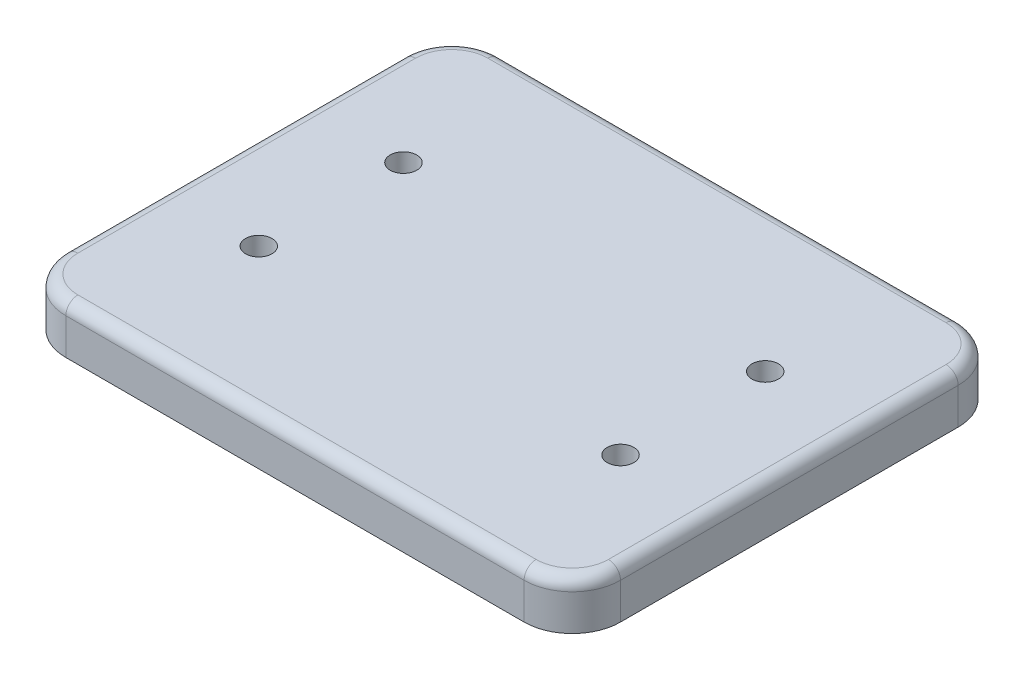
ISO-10303-21;
HEADER;
FILE_DESCRIPTION(('STEP AP214'),'2;1');
FILE_NAME('part.step','',(''),(''),'','','');
FILE_SCHEMA(('AUTOMOTIVE_DESIGN { 1 0 10303 214 1 1 1 1 }'));
ENDSEC;
DATA;
#1=APPLICATION_CONTEXT('core data for automotive mechanical design processes');
#2=APPLICATION_PROTOCOL_DEFINITION('international standard','automotive_design',2000,#1);
#3=PRODUCT_CONTEXT('',#1,'mechanical');
#4=PRODUCT('Part','Part','',(#3));
#5=PRODUCT_RELATED_PRODUCT_CATEGORY('part','',(#4));
#6=PRODUCT_DEFINITION_FORMATION('','',#4);
#7=PRODUCT_DEFINITION_CONTEXT('part definition',#1,'design');
#8=PRODUCT_DEFINITION('design','',#6,#7);
#9=PRODUCT_DEFINITION_SHAPE('','',#8);
#10=(LENGTH_UNIT() NAMED_UNIT(*) SI_UNIT(.MILLI.,.METRE.));
#11=(NAMED_UNIT(*) PLANE_ANGLE_UNIT() SI_UNIT($,.RADIAN.));
#12=(NAMED_UNIT(*) SI_UNIT($,.STERADIAN.) SOLID_ANGLE_UNIT());
#13=UNCERTAINTY_MEASURE_WITH_UNIT(LENGTH_MEASURE(1.E-05),#10,'distance_accuracy_value','');
#14=(GEOMETRIC_REPRESENTATION_CONTEXT(3) GLOBAL_UNCERTAINTY_ASSIGNED_CONTEXT((#13)) GLOBAL_UNIT_ASSIGNED_CONTEXT((#10,
#11,#12)) REPRESENTATION_CONTEXT('',''));
#15=CARTESIAN_POINT('',(0.,0.,0.));
#16=DIRECTION('',(0.,0.,1.));
#17=DIRECTION('',(1.,0.,0.));
#18=AXIS2_PLACEMENT_3D('',#15,#16,#17);
#19=CARTESIAN_POINT('',(115.,20.,90.));
#20=DIRECTION('',(-1.,0.,0.));
#21=DIRECTION('',(0.,0.,1.));
#22=AXIS2_PLACEMENT_3D('',#19,#20,#21);
#23=PLANE('',#22);
#24=DIRECTION('',(0.,-1.,0.));
#25=VECTOR('',#24,1.);
#26=CARTESIAN_POINT('',(115.,20.,-70.));
#27=LINE('',#26,#25);
#28=CARTESIAN_POINT('',(115.,0.,-69.9999999999999));
#29=VERTEX_POINT('',#28);
#30=CARTESIAN_POINT('',(115.,15.,-70.));
#31=VERTEX_POINT('',#30);
#32=EDGE_CURVE('E196',#29,#31,#27,.F.);
#33=ORIENTED_EDGE('',*,*,#32,.T.);
#34=DIRECTION('',(0.,0.,-1.));
#35=VECTOR('',#34,1.);
#36=CARTESIAN_POINT('',(115.,15.,90.));
#37=LINE('',#36,#35);
#38=CARTESIAN_POINT('',(115.,15.,70.));
#39=VERTEX_POINT('',#38);
#40=EDGE_CURVE('E70',#31,#39,#37,.F.);
#41=ORIENTED_EDGE('',*,*,#40,.T.);
#42=DIRECTION('',(0.,-1.,0.));
#43=VECTOR('',#42,1.);
#44=CARTESIAN_POINT('',(115.,20.,70.));
#45=LINE('',#44,#43);
#46=CARTESIAN_POINT('',(115.,0.,70.));
#47=VERTEX_POINT('',#46);
#48=EDGE_CURVE('E193',#39,#47,#45,.T.);
#49=ORIENTED_EDGE('',*,*,#48,.T.);
#50=DIRECTION('',(0.,0.,-1.));
#51=VECTOR('',#50,1.);
#52=CARTESIAN_POINT('',(115.,0.,90.));
#53=LINE('',#52,#51);
#54=EDGE_CURVE('E273',#47,#29,#53,.T.);
#55=ORIENTED_EDGE('',*,*,#54,.T.);
#56=EDGE_LOOP('',(#33,#41,#49,#55));
#57=FACE_BOUND('',#56,.T.);
#58=ADVANCED_FACE('F45',(#57),#23,.F.);
#59=CARTESIAN_POINT('',(-115.,20.,-90.));
#60=DIRECTION('',(0.,0.,1.));
#61=DIRECTION('',(1.,0.,0.));
#62=AXIS2_PLACEMENT_3D('',#59,#60,#61);
#63=PLANE('',#62);
#64=DIRECTION('',(0.,-1.,0.));
#65=VECTOR('',#64,1.);
#66=CARTESIAN_POINT('',(-95.,20.,-90.));
#67=LINE('',#66,#65);
#68=CARTESIAN_POINT('',(-95.,0.,-90.));
#69=VERTEX_POINT('',#68);
#70=CARTESIAN_POINT('',(-95.,15.,-90.));
#71=VERTEX_POINT('',#70);
#72=EDGE_CURVE('E189',#69,#71,#67,.F.);
#73=ORIENTED_EDGE('',*,*,#72,.T.);
#74=DIRECTION('',(-1.,0.,0.));
#75=VECTOR('',#74,1.);
#76=CARTESIAN_POINT('',(-115.,15.,-90.));
#77=LINE('',#76,#75);
#78=CARTESIAN_POINT('',(95.,15.,-90.));
#79=VERTEX_POINT('',#78);
#80=EDGE_CURVE('E233',#71,#79,#77,.F.);
#81=ORIENTED_EDGE('',*,*,#80,.T.);
#82=DIRECTION('',(0.,-1.,0.));
#83=VECTOR('',#82,1.);
#84=CARTESIAN_POINT('',(95.,20.,-90.));
#85=LINE('',#84,#83);
#86=CARTESIAN_POINT('',(95.,0.,-90.));
#87=VERTEX_POINT('',#86);
#88=EDGE_CURVE('E186',#79,#87,#85,.T.);
#89=ORIENTED_EDGE('',*,*,#88,.T.);
#90=DIRECTION('',(-1.,0.,0.));
#91=VECTOR('',#90,1.);
#92=CARTESIAN_POINT('',(-115.,0.,-90.));
#93=LINE('',#92,#91);
#94=EDGE_CURVE('E171',#87,#69,#93,.T.);
#95=ORIENTED_EDGE('',*,*,#94,.T.);
#96=EDGE_LOOP('',(#73,#81,#89,#95));
#97=FACE_BOUND('',#96,.T.);
#98=ADVANCED_FACE('F379',(#97),#63,.F.);
#99=CARTESIAN_POINT('',(-115.,20.,90.));
#100=DIRECTION('',(1.,0.,0.));
#101=DIRECTION('',(0.,0.,-1.));
#102=AXIS2_PLACEMENT_3D('',#99,#100,#101);
#103=PLANE('',#102);
#104=DIRECTION('',(0.,-1.,0.));
#105=VECTOR('',#104,1.);
#106=CARTESIAN_POINT('',(-115.,20.,70.));
#107=LINE('',#106,#105);
#108=CARTESIAN_POINT('',(-115.,0.,70.));
#109=VERTEX_POINT('',#108);
#110=CARTESIAN_POINT('',(-115.,15.,70.));
#111=VERTEX_POINT('',#110);
#112=EDGE_CURVE('E154',#109,#111,#107,.F.);
#113=ORIENTED_EDGE('',*,*,#112,.T.);
#114=DIRECTION('',(0.,0.,1.));
#115=VECTOR('',#114,1.);
#116=CARTESIAN_POINT('',(-115.,15.,90.));
#117=LINE('',#116,#115);
#118=CARTESIAN_POINT('',(-115.,15.,-70.));
#119=VERTEX_POINT('',#118);
#120=EDGE_CURVE('E227',#111,#119,#117,.F.);
#121=ORIENTED_EDGE('',*,*,#120,.T.);
#122=DIRECTION('',(0.,-1.,0.));
#123=VECTOR('',#122,1.);
#124=CARTESIAN_POINT('',(-115.,20.,-70.));
#125=LINE('',#124,#123);
#126=CARTESIAN_POINT('',(-115.,0.,-69.9999999999999));
#127=VERTEX_POINT('',#126);
#128=EDGE_CURVE('E159',#119,#127,#125,.T.);
#129=ORIENTED_EDGE('',*,*,#128,.T.);
#130=DIRECTION('',(0.,0.,1.));
#131=VECTOR('',#130,1.);
#132=CARTESIAN_POINT('',(-115.,0.,90.));
#133=LINE('',#132,#131);
#134=EDGE_CURVE('E166',#127,#109,#133,.T.);
#135=ORIENTED_EDGE('',*,*,#134,.T.);
#136=EDGE_LOOP('',(#113,#121,#129,#135));
#137=FACE_BOUND('',#136,.T.);
#138=ADVANCED_FACE('F384',(#137),#103,.F.);
#139=CARTESIAN_POINT('',(-115.,20.,90.));
#140=DIRECTION('',(0.,0.,-1.));
#141=DIRECTION('',(-1.,0.,0.));
#142=AXIS2_PLACEMENT_3D('',#139,#140,#141);
#143=PLANE('',#142);
#144=DIRECTION('',(0.,-1.,0.));
#145=VECTOR('',#144,1.);
#146=CARTESIAN_POINT('',(95.,20.,90.));
#147=LINE('',#146,#145);
#148=CARTESIAN_POINT('',(95.,0.,90.));
#149=VERTEX_POINT('',#148);
#150=CARTESIAN_POINT('',(95.,15.,90.));
#151=VERTEX_POINT('',#150);
#152=EDGE_CURVE('E148',#149,#151,#147,.F.);
#153=ORIENTED_EDGE('',*,*,#152,.T.);
#154=DIRECTION('',(1.,0.,0.));
#155=VECTOR('',#154,1.);
#156=CARTESIAN_POINT('',(-115.,15.,90.));
#157=LINE('',#156,#155);
#158=CARTESIAN_POINT('',(-95.,15.,90.));
#159=VERTEX_POINT('',#158);
#160=EDGE_CURVE('E11',#151,#159,#157,.F.);
#161=ORIENTED_EDGE('',*,*,#160,.T.);
#162=DIRECTION('',(0.,-1.,0.));
#163=VECTOR('',#162,1.);
#164=CARTESIAN_POINT('',(-95.,20.,90.));
#165=LINE('',#164,#163);
#166=CARTESIAN_POINT('',(-95.,0.,90.));
#167=VERTEX_POINT('',#166);
#168=EDGE_CURVE('E137',#159,#167,#165,.T.);
#169=ORIENTED_EDGE('',*,*,#168,.T.);
#170=DIRECTION('',(1.,0.,0.));
#171=VECTOR('',#170,1.);
#172=CARTESIAN_POINT('',(-115.,0.,90.));
#173=LINE('',#172,#171);
#174=EDGE_CURVE('E141',#167,#149,#173,.T.);
#175=ORIENTED_EDGE('',*,*,#174,.T.);
#176=EDGE_LOOP('',(#153,#161,#169,#175));
#177=FACE_BOUND('',#176,.T.);
#178=ADVANCED_FACE('F139',(#177),#143,.F.);
#179=CARTESIAN_POINT('',(0.,20.,0.));
#180=DIRECTION('',(0.,-1.,0.));
#181=DIRECTION('',(0.,0.,-1.));
#182=AXIS2_PLACEMENT_3D('',#179,#180,#181);
#183=PLANE('',#182);
#184=CARTESIAN_POINT('',(75.,20.,-30.));
#185=DIRECTION('',(0.,-1.,0.));
#186=DIRECTION('',(0.,0.,-1.));
#187=AXIS2_PLACEMENT_3D('',#184,#185,#186);
#188=CIRCLE('',#187,5.50000000000001);
#189=CARTESIAN_POINT('',(75.,20.,-35.5));
#190=VERTEX_POINT('',#189);
#191=EDGE_CURVE('E332',#190,#190,#188,.T.);
#192=ORIENTED_EDGE('',*,*,#191,.T.);
#193=EDGE_LOOP('',(#192));
#194=FACE_BOUND('',#193,.T.);
#195=CARTESIAN_POINT('',(75.,20.,30.));
#196=DIRECTION('',(0.,-1.,0.));
#197=DIRECTION('',(0.,0.,-1.));
#198=AXIS2_PLACEMENT_3D('',#195,#196,#197);
#199=CIRCLE('',#198,5.50000000000001);
#200=CARTESIAN_POINT('',(75.,20.,24.5));
#201=VERTEX_POINT('',#200);
#202=EDGE_CURVE('E316',#201,#201,#199,.T.);
#203=ORIENTED_EDGE('',*,*,#202,.T.);
#204=EDGE_LOOP('',(#203));
#205=FACE_BOUND('',#204,.T.);
#206=CARTESIAN_POINT('',(-75.,20.,30.));
#207=DIRECTION('',(0.,-1.,0.));
#208=DIRECTION('',(0.,0.,-1.));
#209=AXIS2_PLACEMENT_3D('',#206,#207,#208);
#210=CIRCLE('',#209,5.50000000000001);
#211=CARTESIAN_POINT('',(-75.,20.,24.5));
#212=VERTEX_POINT('',#211);
#213=EDGE_CURVE('E300',#212,#212,#210,.T.);
#214=ORIENTED_EDGE('',*,*,#213,.T.);
#215=EDGE_LOOP('',(#214));
#216=FACE_BOUND('',#215,.T.);
#217=CARTESIAN_POINT('',(-75.,20.,-30.));
#218=DIRECTION('',(0.,-1.,0.));
#219=DIRECTION('',(0.,0.,-1.));
#220=AXIS2_PLACEMENT_3D('',#217,#218,#219);
#221=CIRCLE('',#220,5.50000000000001);
#222=CARTESIAN_POINT('',(-75.,20.,-35.5));
#223=VERTEX_POINT('',#222);
#224=EDGE_CURVE('E247',#223,#223,#221,.T.);
#225=ORIENTED_EDGE('',*,*,#224,.T.);
#226=EDGE_LOOP('',(#225));
#227=FACE_BOUND('',#226,.T.);
#228=DIRECTION('',(0.,0.,1.));
#229=VECTOR('',#228,1.);
#230=CARTESIAN_POINT('',(-110.,20.,0.));
#231=LINE('',#230,#229);
#232=CARTESIAN_POINT('',(-110.,20.,-70.));
#233=VERTEX_POINT('',#232);
#234=CARTESIAN_POINT('',(-110.,20.,70.));
#235=VERTEX_POINT('',#234);
#236=EDGE_CURVE('E217',#233,#235,#231,.T.);
#237=ORIENTED_EDGE('',*,*,#236,.T.);
#238=CARTESIAN_POINT('',(-95.,20.,70.));
#239=DIRECTION('',(0.,-1.,0.));
#240=DIRECTION('',(0.,0.,-1.));
#241=AXIS2_PLACEMENT_3D('',#238,#239,#240);
#242=CIRCLE('',#241,15.);
#243=CARTESIAN_POINT('',(-95.,20.,85.));
#244=VERTEX_POINT('',#243);
#245=EDGE_CURVE('E220',#235,#244,#242,.F.);
#246=ORIENTED_EDGE('',*,*,#245,.T.);
#247=DIRECTION('',(1.,0.,0.));
#248=VECTOR('',#247,1.);
#249=CARTESIAN_POINT('',(0.,20.,85.));
#250=LINE('',#249,#248);
#251=CARTESIAN_POINT('',(95.,20.,85.));
#252=VERTEX_POINT('',#251);
#253=EDGE_CURVE('E199',#244,#252,#250,.T.);
#254=ORIENTED_EDGE('',*,*,#253,.T.);
#255=CARTESIAN_POINT('',(95.,20.,70.));
#256=DIRECTION('',(0.,-1.,0.));
#257=DIRECTION('',(0.,0.,-1.));
#258=AXIS2_PLACEMENT_3D('',#255,#256,#257);
#259=CIRCLE('',#258,15.);
#260=CARTESIAN_POINT('',(110.,20.,70.));
#261=VERTEX_POINT('',#260);
#262=EDGE_CURVE('E202',#252,#261,#259,.F.);
#263=ORIENTED_EDGE('',*,*,#262,.T.);
#264=DIRECTION('',(0.,0.,-1.));
#265=VECTOR('',#264,1.);
#266=CARTESIAN_POINT('',(110.,20.,0.));
#267=LINE('',#266,#265);
#268=CARTESIAN_POINT('',(110.,20.,-70.));
#269=VERTEX_POINT('',#268);
#270=EDGE_CURVE('E205',#261,#269,#267,.T.);
#271=ORIENTED_EDGE('',*,*,#270,.T.);
#272=CARTESIAN_POINT('',(95.,20.,-70.));
#273=DIRECTION('',(0.,-1.,0.));
#274=DIRECTION('',(0.,0.,-1.));
#275=AXIS2_PLACEMENT_3D('',#272,#273,#274);
#276=CIRCLE('',#275,15.);
#277=CARTESIAN_POINT('',(95.,20.,-85.));
#278=VERTEX_POINT('',#277);
#279=EDGE_CURVE('E208',#269,#278,#276,.F.);
#280=ORIENTED_EDGE('',*,*,#279,.T.);
#281=DIRECTION('',(-1.,0.,0.));
#282=VECTOR('',#281,1.);
#283=CARTESIAN_POINT('',(0.,20.,-85.));
#284=LINE('',#283,#282);
#285=CARTESIAN_POINT('',(-95.,20.,-85.));
#286=VERTEX_POINT('',#285);
#287=EDGE_CURVE('E211',#278,#286,#284,.T.);
#288=ORIENTED_EDGE('',*,*,#287,.T.);
#289=CARTESIAN_POINT('',(-95.,20.,-70.));
#290=DIRECTION('',(0.,-1.,0.));
#291=DIRECTION('',(0.,0.,-1.));
#292=AXIS2_PLACEMENT_3D('',#289,#290,#291);
#293=CIRCLE('',#292,15.);
#294=EDGE_CURVE('E214',#286,#233,#293,.F.);
#295=ORIENTED_EDGE('',*,*,#294,.T.);
#296=EDGE_LOOP('',(#237,#246,#254,#263,#271,#280,#288,#295));
#297=FACE_BOUND('',#296,.T.);
#298=ADVANCED_FACE('F353',(#194,#205,#216,#227,#297),#183,.F.);
#299=CARTESIAN_POINT('',(0.,0.,0.));
#300=DIRECTION('',(0.,-1.,0.));
#301=DIRECTION('',(0.,0.,-1.));
#302=AXIS2_PLACEMENT_3D('',#299,#300,#301);
#303=PLANE('',#302);
#304=CARTESIAN_POINT('',(75.,0.,-30.));
#305=DIRECTION('',(0.,-1.,0.));
#306=DIRECTION('',(0.,0.,-1.));
#307=AXIS2_PLACEMENT_3D('',#304,#305,#306);
#308=CIRCLE('',#307,8.99999999999999);
#309=CARTESIAN_POINT('',(75.,0.,-39.));
#310=VERTEX_POINT('',#309);
#311=EDGE_CURVE('E344',#310,#310,#308,.T.);
#312=ORIENTED_EDGE('',*,*,#311,.F.);
#313=EDGE_LOOP('',(#312));
#314=FACE_BOUND('',#313,.T.);
#315=CARTESIAN_POINT('',(75.,0.,30.));
#316=DIRECTION('',(0.,-1.,0.));
#317=DIRECTION('',(0.,0.,-1.));
#318=AXIS2_PLACEMENT_3D('',#315,#316,#317);
#319=CIRCLE('',#318,8.99999999999999);
#320=CARTESIAN_POINT('',(75.,0.,21.));
#321=VERTEX_POINT('',#320);
#322=EDGE_CURVE('E328',#321,#321,#319,.T.);
#323=ORIENTED_EDGE('',*,*,#322,.F.);
#324=EDGE_LOOP('',(#323));
#325=FACE_BOUND('',#324,.T.);
#326=CARTESIAN_POINT('',(-75.,0.,30.));
#327=DIRECTION('',(0.,-1.,0.));
#328=DIRECTION('',(0.,0.,-1.));
#329=AXIS2_PLACEMENT_3D('',#326,#327,#328);
#330=CIRCLE('',#329,8.99999999999999);
#331=CARTESIAN_POINT('',(-75.,0.,21.));
#332=VERTEX_POINT('',#331);
#333=EDGE_CURVE('E312',#332,#332,#330,.T.);
#334=ORIENTED_EDGE('',*,*,#333,.F.);
#335=EDGE_LOOP('',(#334));
#336=FACE_BOUND('',#335,.T.);
#337=CARTESIAN_POINT('',(-75.,0.,-30.));
#338=DIRECTION('',(0.,-1.,0.));
#339=DIRECTION('',(0.,0.,-1.));
#340=AXIS2_PLACEMENT_3D('',#337,#338,#339);
#341=CIRCLE('',#340,8.99999999999999);
#342=CARTESIAN_POINT('',(-75.,0.,-39.));
#343=VERTEX_POINT('',#342);
#344=EDGE_CURVE('E296',#343,#343,#341,.T.);
#345=ORIENTED_EDGE('',*,*,#344,.F.);
#346=EDGE_LOOP('',(#345));
#347=FACE_BOUND('',#346,.T.);
#348=ORIENTED_EDGE('',*,*,#174,.F.);
#349=CARTESIAN_POINT('',(-95.,0.,70.));
#350=DIRECTION('',(0.,-1.,0.));
#351=DIRECTION('',(0.,0.,-1.));
#352=AXIS2_PLACEMENT_3D('',#349,#350,#351);
#353=CIRCLE('',#352,20.);
#354=EDGE_CURVE('E151',#167,#109,#353,.T.);
#355=ORIENTED_EDGE('',*,*,#354,.T.);
#356=ORIENTED_EDGE('',*,*,#134,.F.);
#357=CARTESIAN_POINT('',(-95.,0.,-70.));
#358=DIRECTION('',(0.,-1.,0.));
#359=DIRECTION('',(0.,0.,-1.));
#360=AXIS2_PLACEMENT_3D('',#357,#358,#359);
#361=CIRCLE('',#360,20.);
#362=EDGE_CURVE('E160',#127,#69,#361,.T.);
#363=ORIENTED_EDGE('',*,*,#362,.T.);
#364=ORIENTED_EDGE('',*,*,#94,.F.);
#365=CARTESIAN_POINT('',(95.,0.,-70.));
#366=DIRECTION('',(0.,-1.,0.));
#367=DIRECTION('',(0.,0.,-1.));
#368=AXIS2_PLACEMENT_3D('',#365,#366,#367);
#369=CIRCLE('',#368,20.);
#370=EDGE_CURVE('E177',#87,#29,#369,.T.);
#371=ORIENTED_EDGE('',*,*,#370,.T.);
#372=ORIENTED_EDGE('',*,*,#54,.F.);
#373=CARTESIAN_POINT('',(95.,0.,70.));
#374=DIRECTION('',(0.,-1.,0.));
#375=DIRECTION('',(0.,0.,-1.));
#376=AXIS2_PLACEMENT_3D('',#373,#374,#375);
#377=CIRCLE('',#376,20.);
#378=EDGE_CURVE('E147',#47,#149,#377,.T.);
#379=ORIENTED_EDGE('',*,*,#378,.T.);
#380=EDGE_LOOP('',(#348,#355,#356,#363,#364,#371,#372,#379));
#381=FACE_BOUND('',#380,.T.);
#382=ADVANCED_FACE('F162',(#314,#325,#336,#347,#381),#303,.T.);
#383=CARTESIAN_POINT('',(-95.,20.,70.));
#384=DIRECTION('',(0.,-1.,0.));
#385=DIRECTION('',(0.,0.,-1.));
#386=AXIS2_PLACEMENT_3D('',#383,#384,#385);
#387=CYLINDRICAL_SURFACE('',#386,20.);
#388=ORIENTED_EDGE('',*,*,#168,.F.);
#389=CARTESIAN_POINT('',(-95.,15.,70.));
#390=DIRECTION('',(0.,-1.,0.));
#391=DIRECTION('',(0.,0.,-1.));
#392=AXIS2_PLACEMENT_3D('',#389,#390,#391);
#393=CIRCLE('',#392,20.);
#394=EDGE_CURVE('E224',#159,#111,#393,.T.);
#395=ORIENTED_EDGE('',*,*,#394,.T.);
#396=ORIENTED_EDGE('',*,*,#112,.F.);
#397=ORIENTED_EDGE('',*,*,#354,.F.);
#398=EDGE_LOOP('',(#388,#395,#396,#397));
#399=FACE_BOUND('',#398,.T.);
#400=ADVANCED_FACE('F152',(#399),#387,.T.);
#401=CARTESIAN_POINT('',(-95.,20.,-70.));
#402=DIRECTION('',(0.,-1.,0.));
#403=DIRECTION('',(0.,0.,-1.));
#404=AXIS2_PLACEMENT_3D('',#401,#402,#403);
#405=CYLINDRICAL_SURFACE('',#404,20.);
#406=ORIENTED_EDGE('',*,*,#128,.F.);
#407=CARTESIAN_POINT('',(-95.,15.,-70.));
#408=DIRECTION('',(0.,-1.,0.));
#409=DIRECTION('',(0.,0.,-1.));
#410=AXIS2_PLACEMENT_3D('',#407,#408,#409);
#411=CIRCLE('',#410,20.);
#412=EDGE_CURVE('E230',#119,#71,#411,.T.);
#413=ORIENTED_EDGE('',*,*,#412,.T.);
#414=ORIENTED_EDGE('',*,*,#72,.F.);
#415=ORIENTED_EDGE('',*,*,#362,.F.);
#416=EDGE_LOOP('',(#406,#413,#414,#415));
#417=FACE_BOUND('',#416,.T.);
#418=ADVANCED_FACE('F391',(#417),#405,.T.);
#419=CARTESIAN_POINT('',(95.,20.,-70.));
#420=DIRECTION('',(0.,-1.,0.));
#421=DIRECTION('',(0.,0.,-1.));
#422=AXIS2_PLACEMENT_3D('',#419,#420,#421);
#423=CYLINDRICAL_SURFACE('',#422,20.);
#424=ORIENTED_EDGE('',*,*,#88,.F.);
#425=CARTESIAN_POINT('',(95.,15.,-70.));
#426=DIRECTION('',(0.,-1.,0.));
#427=DIRECTION('',(0.,0.,-1.));
#428=AXIS2_PLACEMENT_3D('',#425,#426,#427);
#429=CIRCLE('',#428,20.);
#430=EDGE_CURVE('E236',#79,#31,#429,.T.);
#431=ORIENTED_EDGE('',*,*,#430,.T.);
#432=ORIENTED_EDGE('',*,*,#32,.F.);
#433=ORIENTED_EDGE('',*,*,#370,.F.);
#434=EDGE_LOOP('',(#424,#431,#432,#433));
#435=FACE_BOUND('',#434,.T.);
#436=ADVANCED_FACE('F394',(#435),#423,.T.);
#437=CARTESIAN_POINT('',(95.,20.,70.));
#438=DIRECTION('',(0.,-1.,0.));
#439=DIRECTION('',(0.,0.,-1.));
#440=AXIS2_PLACEMENT_3D('',#437,#438,#439);
#441=CYLINDRICAL_SURFACE('',#440,20.);
#442=ORIENTED_EDGE('',*,*,#48,.F.);
#443=CARTESIAN_POINT('',(95.,15.,70.));
#444=DIRECTION('',(0.,-1.,0.));
#445=DIRECTION('',(0.,0.,-1.));
#446=AXIS2_PLACEMENT_3D('',#443,#444,#445);
#447=CIRCLE('',#446,20.);
#448=EDGE_CURVE('E55',#39,#151,#447,.T.);
#449=ORIENTED_EDGE('',*,*,#448,.T.);
#450=ORIENTED_EDGE('',*,*,#152,.F.);
#451=ORIENTED_EDGE('',*,*,#378,.F.);
#452=EDGE_LOOP('',(#442,#449,#450,#451));
#453=FACE_BOUND('',#452,.T.);
#454=ADVANCED_FACE('F398',(#453),#441,.T.);
#455=CARTESIAN_POINT('',(95.,15.,-70.));
#456=DIRECTION('',(0.,-1.,0.));
#457=DIRECTION('',(0.,0.,-1.));
#458=AXIS2_PLACEMENT_3D('',#455,#456,#457);
#459=TOROIDAL_SURFACE('',#458,15.,5.);
#460=CARTESIAN_POINT('',(110.,15.,-70.));
#461=DIRECTION('',(0.,0.,1.));
#462=DIRECTION('',(1.,0.,0.));
#463=AXIS2_PLACEMENT_3D('',#460,#461,#462);
#464=CIRCLE('',#463,5.);
#465=EDGE_CURVE('E265',#31,#269,#464,.T.);
#466=ORIENTED_EDGE('',*,*,#465,.F.);
#467=ORIENTED_EDGE('',*,*,#430,.F.);
#468=CARTESIAN_POINT('',(95.,15.,-85.));
#469=DIRECTION('',(-1.,0.,0.));
#470=DIRECTION('',(0.,0.,1.));
#471=AXIS2_PLACEMENT_3D('',#468,#469,#470);
#472=CIRCLE('',#471,5.);
#473=EDGE_CURVE('E49',#278,#79,#472,.T.);
#474=ORIENTED_EDGE('',*,*,#473,.F.);
#475=ORIENTED_EDGE('',*,*,#279,.F.);
#476=EDGE_LOOP('',(#466,#467,#474,#475));
#477=FACE_BOUND('',#476,.T.);
#478=ADVANCED_FACE('F47',(#477),#459,.T.);
#479=CARTESIAN_POINT('',(0.,15.,-85.));
#480=DIRECTION('',(-1.,0.,0.));
#481=DIRECTION('',(0.,0.,1.));
#482=AXIS2_PLACEMENT_3D('',#479,#480,#481);
#483=CYLINDRICAL_SURFACE('',#482,5.);
#484=ORIENTED_EDGE('',*,*,#473,.T.);
#485=ORIENTED_EDGE('',*,*,#80,.F.);
#486=CARTESIAN_POINT('',(-95.,15.,-85.));
#487=DIRECTION('',(-1.,0.,0.));
#488=DIRECTION('',(0.,0.,1.));
#489=AXIS2_PLACEMENT_3D('',#486,#487,#488);
#490=CIRCLE('',#489,5.);
#491=EDGE_CURVE('E262',#286,#71,#490,.T.);
#492=ORIENTED_EDGE('',*,*,#491,.F.);
#493=ORIENTED_EDGE('',*,*,#287,.F.);
#494=EDGE_LOOP('',(#484,#485,#492,#493));
#495=FACE_BOUND('',#494,.T.);
#496=ADVANCED_FACE('F424',(#495),#483,.T.);
#497=CARTESIAN_POINT('',(110.,15.,0.));
#498=DIRECTION('',(0.,0.,-1.));
#499=DIRECTION('',(-1.,0.,0.));
#500=AXIS2_PLACEMENT_3D('',#497,#498,#499);
#501=CYLINDRICAL_SURFACE('',#500,5.);
#502=ORIENTED_EDGE('',*,*,#465,.T.);
#503=ORIENTED_EDGE('',*,*,#270,.F.);
#504=CARTESIAN_POINT('',(110.,15.,70.));
#505=DIRECTION('',(0.,0.,1.));
#506=DIRECTION('',(1.,0.,0.));
#507=AXIS2_PLACEMENT_3D('',#504,#505,#506);
#508=CIRCLE('',#507,5.);
#509=EDGE_CURVE('E258',#39,#261,#508,.T.);
#510=ORIENTED_EDGE('',*,*,#509,.F.);
#511=ORIENTED_EDGE('',*,*,#40,.F.);
#512=EDGE_LOOP('',(#502,#503,#510,#511));
#513=FACE_BOUND('',#512,.T.);
#514=ADVANCED_FACE('F421',(#513),#501,.T.);
#515=CARTESIAN_POINT('',(-95.,15.,-70.));
#516=DIRECTION('',(0.,-1.,0.));
#517=DIRECTION('',(0.,0.,-1.));
#518=AXIS2_PLACEMENT_3D('',#515,#516,#517);
#519=TOROIDAL_SURFACE('',#518,15.,5.);
#520=ORIENTED_EDGE('',*,*,#491,.T.);
#521=ORIENTED_EDGE('',*,*,#412,.F.);
#522=CARTESIAN_POINT('',(-110.,15.,-70.));
#523=DIRECTION('',(0.,0.,1.));
#524=DIRECTION('',(1.,0.,0.));
#525=AXIS2_PLACEMENT_3D('',#522,#523,#524);
#526=CIRCLE('',#525,5.);
#527=EDGE_CURVE('E254',#233,#119,#526,.T.);
#528=ORIENTED_EDGE('',*,*,#527,.F.);
#529=ORIENTED_EDGE('',*,*,#294,.F.);
#530=EDGE_LOOP('',(#520,#521,#528,#529));
#531=FACE_BOUND('',#530,.T.);
#532=ADVANCED_FACE('F417',(#531),#519,.T.);
#533=CARTESIAN_POINT('',(95.,15.,70.));
#534=DIRECTION('',(0.,-1.,0.));
#535=DIRECTION('',(0.,0.,-1.));
#536=AXIS2_PLACEMENT_3D('',#533,#534,#535);
#537=TOROIDAL_SURFACE('',#536,15.,5.);
#538=ORIENTED_EDGE('',*,*,#509,.T.);
#539=ORIENTED_EDGE('',*,*,#262,.F.);
#540=CARTESIAN_POINT('',(95.,15.,85.));
#541=DIRECTION('',(-1.,0.,0.));
#542=DIRECTION('',(0.,0.,1.));
#543=AXIS2_PLACEMENT_3D('',#540,#541,#542);
#544=CIRCLE('',#543,5.);
#545=EDGE_CURVE('E250',#151,#252,#544,.T.);
#546=ORIENTED_EDGE('',*,*,#545,.F.);
#547=ORIENTED_EDGE('',*,*,#448,.F.);
#548=EDGE_LOOP('',(#538,#539,#546,#547));
#549=FACE_BOUND('',#548,.T.);
#550=ADVANCED_FACE('F413',(#549),#537,.T.);
#551=CARTESIAN_POINT('',(-110.,15.,0.));
#552=DIRECTION('',(0.,0.,1.));
#553=DIRECTION('',(1.,0.,0.));
#554=AXIS2_PLACEMENT_3D('',#551,#552,#553);
#555=CYLINDRICAL_SURFACE('',#554,5.);
#556=ORIENTED_EDGE('',*,*,#527,.T.);
#557=ORIENTED_EDGE('',*,*,#120,.F.);
#558=CARTESIAN_POINT('',(-110.,15.,70.));
#559=DIRECTION('',(0.,0.,1.));
#560=DIRECTION('',(1.,0.,0.));
#561=AXIS2_PLACEMENT_3D('',#558,#559,#560);
#562=CIRCLE('',#561,5.);
#563=EDGE_CURVE('E246',#235,#111,#562,.T.);
#564=ORIENTED_EDGE('',*,*,#563,.F.);
#565=ORIENTED_EDGE('',*,*,#236,.F.);
#566=EDGE_LOOP('',(#556,#557,#564,#565));
#567=FACE_BOUND('',#566,.T.);
#568=ADVANCED_FACE('F409',(#567),#555,.T.);
#569=CARTESIAN_POINT('',(0.,15.,85.));
#570=DIRECTION('',(1.,0.,0.));
#571=DIRECTION('',(0.,0.,-1.));
#572=AXIS2_PLACEMENT_3D('',#569,#570,#571);
#573=CYLINDRICAL_SURFACE('',#572,5.);
#574=ORIENTED_EDGE('',*,*,#545,.T.);
#575=ORIENTED_EDGE('',*,*,#253,.F.);
#576=CARTESIAN_POINT('',(-95.,15.,85.));
#577=DIRECTION('',(-1.,0.,0.));
#578=DIRECTION('',(0.,0.,1.));
#579=AXIS2_PLACEMENT_3D('',#576,#577,#578);
#580=CIRCLE('',#579,5.);
#581=EDGE_CURVE('E243',#159,#244,#580,.T.);
#582=ORIENTED_EDGE('',*,*,#581,.F.);
#583=ORIENTED_EDGE('',*,*,#160,.F.);
#584=EDGE_LOOP('',(#574,#575,#582,#583));
#585=FACE_BOUND('',#584,.T.);
#586=ADVANCED_FACE('F405',(#585),#573,.T.);
#587=CARTESIAN_POINT('',(-95.,15.,70.));
#588=DIRECTION('',(0.,-1.,0.));
#589=DIRECTION('',(0.,0.,-1.));
#590=AXIS2_PLACEMENT_3D('',#587,#588,#589);
#591=TOROIDAL_SURFACE('',#590,15.,5.);
#592=ORIENTED_EDGE('',*,*,#563,.T.);
#593=ORIENTED_EDGE('',*,*,#394,.F.);
#594=ORIENTED_EDGE('',*,*,#581,.T.);
#595=ORIENTED_EDGE('',*,*,#245,.F.);
#596=EDGE_LOOP('',(#592,#593,#594,#595));
#597=FACE_BOUND('',#596,.T.);
#598=ADVANCED_FACE('F402',(#597),#591,.T.);
#599=CARTESIAN_POINT('',(-75.,0.,-30.));
#600=DIRECTION('',(0.,-1.,0.));
#601=DIRECTION('',(0.,0.,-1.));
#602=AXIS2_PLACEMENT_3D('',#599,#600,#601);
#603=CYLINDRICAL_SURFACE('',#602,5.50000000000001);
#604=ORIENTED_EDGE('',*,*,#224,.F.);
#605=EDGE_LOOP('',(#604));
#606=FACE_BOUND('',#605,.T.);
#607=CARTESIAN_POINT('',(-75.,11.,-30.));
#608=DIRECTION('',(0.,-1.,0.));
#609=DIRECTION('',(0.,0.,-1.));
#610=AXIS2_PLACEMENT_3D('',#607,#608,#609);
#611=CIRCLE('',#610,5.50000000000001);
#612=CARTESIAN_POINT('',(-75.,11.,-35.5));
#613=VERTEX_POINT('',#612);
#614=EDGE_CURVE('E288',#613,#613,#611,.T.);
#615=ORIENTED_EDGE('',*,*,#614,.T.);
#616=EDGE_LOOP('',(#615));
#617=FACE_BOUND('',#616,.T.);
#618=ADVANCED_FACE('F374',(#606,#617),#603,.F.);
#619=CARTESIAN_POINT('',(-69.5,11.,-30.));
#620=DIRECTION('',(0.,1.,0.));
#621=DIRECTION('',(0.,0.,1.));
#622=AXIS2_PLACEMENT_3D('',#619,#620,#621);
#623=PLANE('',#622);
#624=ORIENTED_EDGE('',*,*,#614,.F.);
#625=EDGE_LOOP('',(#624));
#626=FACE_BOUND('',#625,.T.);
#627=CARTESIAN_POINT('',(-75.,11.,-30.));
#628=DIRECTION('',(0.,-1.,0.));
#629=DIRECTION('',(0.,0.,-1.));
#630=AXIS2_PLACEMENT_3D('',#627,#628,#629);
#631=CIRCLE('',#630,8.99999999999999);
#632=CARTESIAN_POINT('',(-75.,11.,-39.));
#633=VERTEX_POINT('',#632);
#634=EDGE_CURVE('E292',#633,#633,#631,.T.);
#635=ORIENTED_EDGE('',*,*,#634,.T.);
#636=EDGE_LOOP('',(#635));
#637=FACE_BOUND('',#636,.T.);
#638=ADVANCED_FACE('F364',(#626,#637),#623,.F.);
#639=CARTESIAN_POINT('',(-75.,0.,-30.));
#640=DIRECTION('',(0.,-1.,0.));
#641=DIRECTION('',(0.,0.,-1.));
#642=AXIS2_PLACEMENT_3D('',#639,#640,#641);
#643=CYLINDRICAL_SURFACE('',#642,8.99999999999999);
#644=ORIENTED_EDGE('',*,*,#634,.F.);
#645=EDGE_LOOP('',(#644));
#646=FACE_BOUND('',#645,.T.);
#647=ORIENTED_EDGE('',*,*,#344,.T.);
#648=EDGE_LOOP('',(#647));
#649=FACE_BOUND('',#648,.T.);
#650=ADVANCED_FACE('F361',(#646,#649),#643,.F.);
#651=CARTESIAN_POINT('',(-75.,0.,30.));
#652=DIRECTION('',(0.,-1.,0.));
#653=DIRECTION('',(0.,0.,-1.));
#654=AXIS2_PLACEMENT_3D('',#651,#652,#653);
#655=CYLINDRICAL_SURFACE('',#654,5.50000000000001);
#656=ORIENTED_EDGE('',*,*,#213,.F.);
#657=EDGE_LOOP('',(#656));
#658=FACE_BOUND('',#657,.T.);
#659=CARTESIAN_POINT('',(-75.,11.,30.));
#660=DIRECTION('',(0.,-1.,0.));
#661=DIRECTION('',(0.,0.,-1.));
#662=AXIS2_PLACEMENT_3D('',#659,#660,#661);
#663=CIRCLE('',#662,5.50000000000001);
#664=CARTESIAN_POINT('',(-75.,11.,24.5));
#665=VERTEX_POINT('',#664);
#666=EDGE_CURVE('E304',#665,#665,#663,.T.);
#667=ORIENTED_EDGE('',*,*,#666,.T.);
#668=EDGE_LOOP('',(#667));
#669=FACE_BOUND('',#668,.T.);
#670=ADVANCED_FACE('F363',(#658,#669),#655,.F.);
#671=CARTESIAN_POINT('',(-69.5,11.,30.));
#672=DIRECTION('',(0.,1.,0.));
#673=DIRECTION('',(0.,0.,1.));
#674=AXIS2_PLACEMENT_3D('',#671,#672,#673);
#675=PLANE('',#674);
#676=ORIENTED_EDGE('',*,*,#666,.F.);
#677=EDGE_LOOP('',(#676));
#678=FACE_BOUND('',#677,.T.);
#679=CARTESIAN_POINT('',(-75.,11.,30.));
#680=DIRECTION('',(0.,-1.,0.));
#681=DIRECTION('',(0.,0.,-1.));
#682=AXIS2_PLACEMENT_3D('',#679,#680,#681);
#683=CIRCLE('',#682,9.00000000000001);
#684=CARTESIAN_POINT('',(-75.,11.,21.));
#685=VERTEX_POINT('',#684);
#686=EDGE_CURVE('E308',#685,#685,#683,.T.);
#687=ORIENTED_EDGE('',*,*,#686,.T.);
#688=EDGE_LOOP('',(#687));
#689=FACE_BOUND('',#688,.T.);
#690=ADVANCED_FACE('F371',(#678,#689),#675,.F.);
#691=CARTESIAN_POINT('',(-75.,0.,30.));
#692=DIRECTION('',(0.,-1.,0.));
#693=DIRECTION('',(0.,0.,-1.));
#694=AXIS2_PLACEMENT_3D('',#691,#692,#693);
#695=CYLINDRICAL_SURFACE('',#694,9.);
#696=ORIENTED_EDGE('',*,*,#686,.F.);
#697=EDGE_LOOP('',(#696));
#698=FACE_BOUND('',#697,.T.);
#699=ORIENTED_EDGE('',*,*,#333,.T.);
#700=EDGE_LOOP('',(#699));
#701=FACE_BOUND('',#700,.T.);
#702=ADVANCED_FACE('F573',(#698,#701),#695,.F.);
#703=CARTESIAN_POINT('',(75.,0.,30.));
#704=DIRECTION('',(0.,-1.,0.));
#705=DIRECTION('',(0.,0.,-1.));
#706=AXIS2_PLACEMENT_3D('',#703,#704,#705);
#707=CYLINDRICAL_SURFACE('',#706,5.50000000000001);
#708=ORIENTED_EDGE('',*,*,#202,.F.);
#709=EDGE_LOOP('',(#708));
#710=FACE_BOUND('',#709,.T.);
#711=CARTESIAN_POINT('',(75.,11.,30.));
#712=DIRECTION('',(0.,-1.,0.));
#713=DIRECTION('',(0.,0.,-1.));
#714=AXIS2_PLACEMENT_3D('',#711,#712,#713);
#715=CIRCLE('',#714,5.50000000000001);
#716=CARTESIAN_POINT('',(75.,11.,24.5));
#717=VERTEX_POINT('',#716);
#718=EDGE_CURVE('E320',#717,#717,#715,.T.);
#719=ORIENTED_EDGE('',*,*,#718,.T.);
#720=EDGE_LOOP('',(#719));
#721=FACE_BOUND('',#720,.T.);
#722=ADVANCED_FACE('F583',(#710,#721),#707,.F.);
#723=CARTESIAN_POINT('',(80.5,11.,30.));
#724=DIRECTION('',(0.,1.,0.));
#725=DIRECTION('',(0.,0.,1.));
#726=AXIS2_PLACEMENT_3D('',#723,#724,#725);
#727=PLANE('',#726);
#728=ORIENTED_EDGE('',*,*,#718,.F.);
#729=EDGE_LOOP('',(#728));
#730=FACE_BOUND('',#729,.T.);
#731=CARTESIAN_POINT('',(75.,11.,30.));
#732=DIRECTION('',(0.,-1.,0.));
#733=DIRECTION('',(0.,0.,-1.));
#734=AXIS2_PLACEMENT_3D('',#731,#732,#733);
#735=CIRCLE('',#734,9.00000000000001);
#736=CARTESIAN_POINT('',(75.,11.,21.));
#737=VERTEX_POINT('',#736);
#738=EDGE_CURVE('E324',#737,#737,#735,.T.);
#739=ORIENTED_EDGE('',*,*,#738,.T.);
#740=EDGE_LOOP('',(#739));
#741=FACE_BOUND('',#740,.T.);
#742=ADVANCED_FACE('F593',(#730,#741),#727,.F.);
#743=CARTESIAN_POINT('',(75.,0.,30.));
#744=DIRECTION('',(0.,-1.,0.));
#745=DIRECTION('',(0.,0.,-1.));
#746=AXIS2_PLACEMENT_3D('',#743,#744,#745);
#747=CYLINDRICAL_SURFACE('',#746,9.);
#748=ORIENTED_EDGE('',*,*,#738,.F.);
#749=EDGE_LOOP('',(#748));
#750=FACE_BOUND('',#749,.T.);
#751=ORIENTED_EDGE('',*,*,#322,.T.);
#752=EDGE_LOOP('',(#751));
#753=FACE_BOUND('',#752,.T.);
#754=ADVANCED_FACE('F603',(#750,#753),#747,.F.);
#755=CARTESIAN_POINT('',(75.,0.,-30.));
#756=DIRECTION('',(0.,-1.,0.));
#757=DIRECTION('',(0.,0.,-1.));
#758=AXIS2_PLACEMENT_3D('',#755,#756,#757);
#759=CYLINDRICAL_SURFACE('',#758,5.50000000000001);
#760=ORIENTED_EDGE('',*,*,#191,.F.);
#761=EDGE_LOOP('',(#760));
#762=FACE_BOUND('',#761,.T.);
#763=CARTESIAN_POINT('',(75.,11.,-30.));
#764=DIRECTION('',(0.,-1.,0.));
#765=DIRECTION('',(0.,0.,-1.));
#766=AXIS2_PLACEMENT_3D('',#763,#764,#765);
#767=CIRCLE('',#766,5.50000000000001);
#768=CARTESIAN_POINT('',(75.,11.,-35.5));
#769=VERTEX_POINT('',#768);
#770=EDGE_CURVE('E336',#769,#769,#767,.T.);
#771=ORIENTED_EDGE('',*,*,#770,.T.);
#772=EDGE_LOOP('',(#771));
#773=FACE_BOUND('',#772,.T.);
#774=ADVANCED_FACE('F613',(#762,#773),#759,.F.);
#775=CARTESIAN_POINT('',(80.5,11.,-30.));
#776=DIRECTION('',(0.,1.,0.));
#777=DIRECTION('',(0.,0.,1.));
#778=AXIS2_PLACEMENT_3D('',#775,#776,#777);
#779=PLANE('',#778);
#780=ORIENTED_EDGE('',*,*,#770,.F.);
#781=EDGE_LOOP('',(#780));
#782=FACE_BOUND('',#781,.T.);
#783=CARTESIAN_POINT('',(75.,11.,-30.));
#784=DIRECTION('',(0.,-1.,0.));
#785=DIRECTION('',(0.,0.,-1.));
#786=AXIS2_PLACEMENT_3D('',#783,#784,#785);
#787=CIRCLE('',#786,8.99999999999999);
#788=CARTESIAN_POINT('',(75.,11.,-39.));
#789=VERTEX_POINT('',#788);
#790=EDGE_CURVE('E340',#789,#789,#787,.T.);
#791=ORIENTED_EDGE('',*,*,#790,.T.);
#792=EDGE_LOOP('',(#791));
#793=FACE_BOUND('',#792,.T.);
#794=ADVANCED_FACE('F623',(#782,#793),#779,.F.);
#795=CARTESIAN_POINT('',(75.,0.,-30.));
#796=DIRECTION('',(0.,-1.,0.));
#797=DIRECTION('',(0.,0.,-1.));
#798=AXIS2_PLACEMENT_3D('',#795,#796,#797);
#799=CYLINDRICAL_SURFACE('',#798,8.99999999999999);
#800=ORIENTED_EDGE('',*,*,#790,.F.);
#801=EDGE_LOOP('',(#800));
#802=FACE_BOUND('',#801,.T.);
#803=ORIENTED_EDGE('',*,*,#311,.T.);
#804=EDGE_LOOP('',(#803));
#805=FACE_BOUND('',#804,.T.);
#806=ADVANCED_FACE('F349',(#802,#805),#799,.F.);
#807=CLOSED_SHELL('',(#58,#98,#138,#178,#298,#382,#400,#418,#436,#454,#478,#496,#514,#532,#550,
#568,#586,#598,#618,#638,#650,#670,#690,#702,#722,#742,#754,#774,#794,#806));
#808=MANIFOLD_SOLID_BREP('B2',#807);
#809=ADVANCED_BREP_SHAPE_REPRESENTATION('',(#18,#808),#14);
#810=SHAPE_DEFINITION_REPRESENTATION(#9,#809);
ENDSEC;
END-ISO-10303-21;
